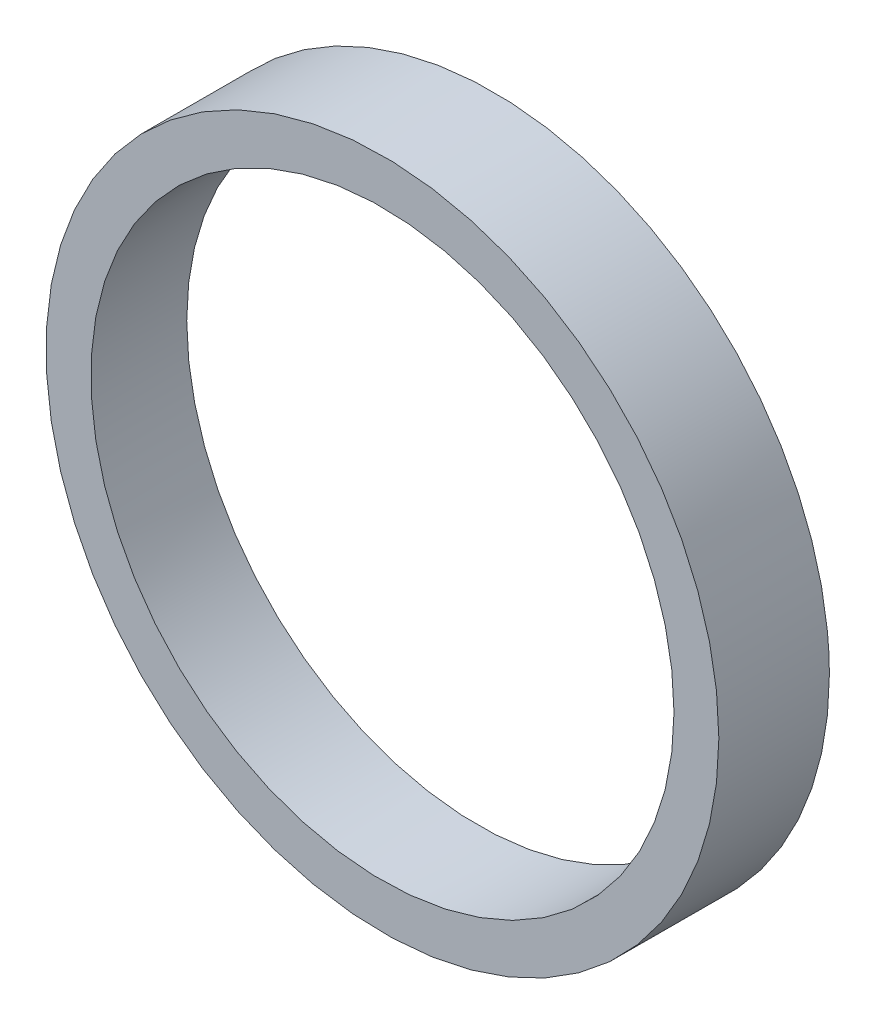
ISO-10303-21;
HEADER;
FILE_DESCRIPTION(('STEP AP214'),'2;1');
FILE_NAME('part.step','',(''),(''),'','','');
FILE_SCHEMA(('AUTOMOTIVE_DESIGN { 1 0 10303 214 1 1 1 1 }'));
ENDSEC;
DATA;
#1=APPLICATION_CONTEXT('core data for automotive mechanical design processes');
#2=APPLICATION_PROTOCOL_DEFINITION('international standard','automotive_design',2000,#1);
#3=PRODUCT_CONTEXT('',#1,'mechanical');
#4=PRODUCT('Part','Part','',(#3));
#5=PRODUCT_RELATED_PRODUCT_CATEGORY('part','',(#4));
#6=PRODUCT_DEFINITION_FORMATION('','',#4);
#7=PRODUCT_DEFINITION_CONTEXT('part definition',#1,'design');
#8=PRODUCT_DEFINITION('design','',#6,#7);
#9=PRODUCT_DEFINITION_SHAPE('','',#8);
#10=(LENGTH_UNIT() NAMED_UNIT(*) SI_UNIT(.MILLI.,.METRE.));
#11=(NAMED_UNIT(*) PLANE_ANGLE_UNIT() SI_UNIT($,.RADIAN.));
#12=(NAMED_UNIT(*) SI_UNIT($,.STERADIAN.) SOLID_ANGLE_UNIT());
#13=UNCERTAINTY_MEASURE_WITH_UNIT(LENGTH_MEASURE(1.E-05),#10,'distance_accuracy_value','');
#14=(GEOMETRIC_REPRESENTATION_CONTEXT(3) GLOBAL_UNCERTAINTY_ASSIGNED_CONTEXT((#13)) GLOBAL_UNIT_ASSIGNED_CONTEXT((#10,
#11,#12)) REPRESENTATION_CONTEXT('',''));
#15=CARTESIAN_POINT('',(0.,0.,0.));
#16=DIRECTION('',(0.,0.,1.));
#17=DIRECTION('',(1.,0.,0.));
#18=AXIS2_PLACEMENT_3D('',#15,#16,#17);
#19=CARTESIAN_POINT('',(0.,0.,10.6862696659689));
#20=DIRECTION('',(0.,0.,1.));
#21=DIRECTION('',(1.,0.,0.));
#22=AXIS2_PLACEMENT_3D('',#19,#20,#21);
#23=CYLINDRICAL_SURFACE('',#22,15.);
#24=CARTESIAN_POINT('',(0.,0.,18.35493));
#25=DIRECTION('',(0.,0.,1.));
#26=DIRECTION('',(1.,0.,0.));
#27=AXIS2_PLACEMENT_3D('',#24,#25,#26);
#28=CIRCLE('',#27,15.);
#29=CARTESIAN_POINT('',(15.,0.,18.35493));
#30=VERTEX_POINT('',#29);
#31=EDGE_CURVE('E11',#30,#30,#28,.T.);
#32=ORIENTED_EDGE('',*,*,#31,.F.);
#33=EDGE_LOOP('',(#32));
#34=FACE_BOUND('',#33,.T.);
#35=CARTESIAN_POINT('',(15.,0.,13.4264068711928));
#36=CARTESIAN_POINT('',(15.0000199770271,-0.245375497034634,13.4264016858656));
#37=CARTESIAN_POINT('',(14.9940151572913,-0.490753610266504,13.4263941756303));
#38=CARTESIAN_POINT('',(14.9699739919427,-0.980521236956322,13.4263883649765));
#39=CARTESIAN_POINT('',(14.9519571377994,-1.22491170772843,13.4263900496695));
#40=CARTESIAN_POINT('',(14.9038844137134,-1.71276826250471,13.4264163961721));
#41=CARTESIAN_POINT('',(14.8738157353264,-1.95623308396081,13.4264410824643));
#42=CARTESIAN_POINT('',(14.8017087579735,-2.4423077301061,13.426467444998));
#43=CARTESIAN_POINT('',(14.7596263284263,-2.68491100057215,13.4264690352615));
#44=CARTESIAN_POINT('',(14.6639170774719,-3.16649439026174,13.4264398724091));
#45=CARTESIAN_POINT('',(14.6103526551995,-3.40548690024482,13.4264092907541));
#46=CARTESIAN_POINT('',(14.4914827437983,-3.8804965677055,13.4263904351009));
#47=CARTESIAN_POINT('',(14.4261790768761,-4.11651418088109,13.426402154542));
#48=CARTESIAN_POINT('',(14.2838779248523,-4.58557269050521,13.426448777783));
#49=CARTESIAN_POINT('',(14.2068545800084,-4.81860573725198,13.4264837334434));
#50=CARTESIAN_POINT('',(14.0411387057669,-5.28168496325176,13.426536273815));
#51=CARTESIAN_POINT('',(13.9523944510197,-5.5117126229414,13.4265537784017));
#52=CARTESIAN_POINT('',(13.7643540661647,-5.96585696918062,13.4265383863849));
#53=CARTESIAN_POINT('',(13.6651219265721,-6.19000014637187,13.426505780671));
#54=CARTESIAN_POINT('',(13.4558068363664,-6.63300015490761,13.4264604982461));
#55=CARTESIAN_POINT('',(13.345730401943,-6.85186006363537,13.4264478096437));
#56=CARTESIAN_POINT('',(13.114772272728,-7.28420755137091,13.426444838234));
#57=CARTESIAN_POINT('',(12.9938752515186,-7.49768694320174,13.4264545877068));
#58=CARTESIAN_POINT('',(12.7412697147233,-7.91914660727904,13.4264979687867));
#59=CARTESIAN_POINT('',(12.6095254708261,-8.12710545907023,13.4265316823551));
#60=CARTESIAN_POINT('',(12.3364835944715,-8.53573934869997,13.4265545030027));
#61=CARTESIAN_POINT('',(12.1952161589136,-8.73643457086651,13.4265437451041));
#62=CARTESIAN_POINT('',(11.9032058467781,-9.13049680803047,13.4264987460191));
#63=CARTESIAN_POINT('',(11.7524727107051,-9.32387103836955,13.4264645286249));
#64=CARTESIAN_POINT('',(11.4415577716528,-9.70311212251682,13.4264132175773));
#65=CARTESIAN_POINT('',(11.2813689996461,-9.88897326465012,13.4263961367251));
#66=CARTESIAN_POINT('',(10.9515775846963,-10.2529943159107,13.4264012746602));
#67=CARTESIAN_POINT('',(10.7819523917999,-10.4311337938327,13.4264235918785));
#68=CARTESIAN_POINT('',(10.4350510958588,-10.7779876087998,13.4264604715956));
#69=CARTESIAN_POINT('',(10.2578183110673,-10.9467452886902,13.426475072972));
#70=CARTESIAN_POINT('',(9.89507441021608,-11.2756767533768,13.4264852388528));
#71=CARTESIAN_POINT('',(9.70955133281081,-11.4358373499339,13.4264807749104));
#72=CARTESIAN_POINT('',(9.33028223983738,-11.747350371589,13.4264776012048));
#73=CARTESIAN_POINT('',(9.13651239684372,-11.8986737869173,13.42647890942));
#74=CARTESIAN_POINT('',(8.74086600476507,-12.1923467797364,13.4264648868347));
#75=CARTESIAN_POINT('',(8.53895548377453,-12.3346505878111,13.4264494774024));
#76=CARTESIAN_POINT('',(8.13106307149784,-12.6073184890543,13.4264153564003));
#77=CARTESIAN_POINT('',(7.9251697883041,-12.737815117026,13.4263966909794));
#78=CARTESIAN_POINT('',(7.50642737861764,-12.9889975965783,13.4263988865024));
#79=CARTESIAN_POINT('',(7.29355499142698,-13.1096446796713,13.4264198964582));
#80=CARTESIAN_POINT('',(6.86099207296762,-13.3409611689156,13.4264778110716));
#81=CARTESIAN_POINT('',(6.64127114661918,-13.4515737140972,13.4265148002023));
#82=CARTESIAN_POINT('',(6.19515479601115,-13.6626606780385,13.4265609556781));
#83=CARTESIAN_POINT('',(5.9687237553191,-13.7630598027787,13.4265699281035));
#84=CARTESIAN_POINT('',(5.51402791410604,-13.9514827666865,13.4265417032825));
#85=CARTESIAN_POINT('',(5.28581988227721,-14.0396435745321,13.4265050722969));
#86=CARTESIAN_POINT('',(4.8251056691939,-14.2047131275852,13.4264589244707));
#87=CARTESIAN_POINT('',(4.59259535343477,-14.2816103402894,13.4264494352382));
#88=CARTESIAN_POINT('',(4.12343672544327,-14.4240588252737,13.4264547165827));
#89=CARTESIAN_POINT('',(3.88677890835644,-14.4895787915964,13.4264695529605));
#90=CARTESIAN_POINT('',(3.40947224609954,-14.6091271936941,13.4265211441416));
#91=CARTESIAN_POINT('',(3.16881041415688,-14.6631037480046,13.4265579951896));
#92=CARTESIAN_POINT('',(2.6858609794817,-14.7591213792078,13.4265827361134));
#93=CARTESIAN_POINT('',(2.44358031067962,-14.8011973619296,13.4265707708002));
#94=CARTESIAN_POINT('',(1.95782398199621,-14.8733704005704,13.4265238616404));
#95=CARTESIAN_POINT('',(1.71435249752584,-14.9034955217487,13.4264889721472));
#96=CARTESIAN_POINT('',(1.22634397069575,-14.9517116967635,13.4264361762349));
#97=CARTESIAN_POINT('',(0.981807528743092,-14.9698088220345,13.4264182612456));
#98=CARTESIAN_POINT('',(0.49180361339278,-14.9939606698047,13.4264013039084));
#99=CARTESIAN_POINT('',(0.246335321211981,-14.9999987555947,13.4264022876134));
#100=CARTESIAN_POINT('',(-0.244621729277353,-15.0000343232038,13.4263997423431));
#101=CARTESIAN_POINT('',(-0.490110487648506,-14.9940308393891,13.4263962130058));
#102=CARTESIAN_POINT('',(-0.980159229208044,-14.9699521874844,13.4264059106652));
#103=CARTESIAN_POINT('',(-1.22472002393864,-14.9518935631179,13.4264191147202));
#104=CARTESIAN_POINT('',(-1.71278043788775,-14.9037533574705,13.4264620267347));
#105=CARTESIAN_POINT('',(-1.95627945029845,-14.8736656308832,13.4264917431328));
#106=CARTESIAN_POINT('',(-2.44209670637423,-14.8015799674755,13.426522853894));
#107=CARTESIAN_POINT('',(-2.68441077687857,-14.7595539370425,13.4265241808812));
#108=CARTESIAN_POINT('',(-3.16690647874843,-14.6637010530643,13.4264908050466));
#109=CARTESIAN_POINT('',(-3.40708615952418,-14.6098643702528,13.4264560721238));
#110=CARTESIAN_POINT('',(-3.88372824943949,-14.49052661448,13.4264240816483));
#111=CARTESIAN_POINT('',(-4.12019997907399,-14.4250627873581,13.4264267064896));
#112=CARTESIAN_POINT('',(-4.58929106521987,-14.2826593263272,13.4264545463942));
#113=CARTESIAN_POINT('',(-4.82191545769364,-14.205736275734,13.4264797290726));
#114=CARTESIAN_POINT('',(-5.28317662143682,-14.0405671603567,13.4265311560645));
#115=CARTESIAN_POINT('',(-5.51181231171785,-13.9523180786074,13.4265574006595));
#116=CARTESIAN_POINT('',(-5.96657181411105,-13.7640134648401,13.426560800411));
#117=CARTESIAN_POINT('',(-6.1926547631023,-13.6638592295564,13.4265375136083));
#118=CARTESIAN_POINT('',(-6.63824920654205,-13.4531450815691,13.4264882588646));
#119=CARTESIAN_POINT('',(-6.85779215603014,-13.3426517071947,13.426462307976));
#120=CARTESIAN_POINT('',(-7.29018835274713,-13.1114839397205,13.4264301348457));
#121=CARTESIAN_POINT('',(-7.50306716185626,-12.9908573712782,13.4264238247474));
#122=CARTESIAN_POINT('',(-7.9220056877183,-12.7396112671199,13.426449501555));
#123=CARTESIAN_POINT('',(-8.12808332657684,-12.6090216050106,13.4264813778836));
#124=CARTESIAN_POINT('',(-8.53660118817628,-12.3360538225568,13.426518064495));
#125=CARTESIAN_POINT('',(-8.73894575274793,-12.1935325696605,13.4265224768191));
#126=CARTESIAN_POINT('',(-9.13515396813438,-11.8996438628237,13.4264999262729));
#127=CARTESIAN_POINT('',(-9.32906262045503,-11.7483370862344,13.4264731587986));
#128=CARTESIAN_POINT('',(-9.70830302597491,-11.437077316119,13.4264305602407));
#129=CARTESIAN_POINT('',(-9.8936705388231,-11.277167902863,13.4264146787714));
#130=CARTESIAN_POINT('',(-10.2557712706995,-10.9489336332832,13.4264014549327));
#131=CARTESIAN_POINT('',(-10.4325290337047,-10.7806358487504,13.4264040563296));
#132=CARTESIAN_POINT('',(-10.7792440747884,-10.4339904913696,13.4264115487304));
#133=CARTESIAN_POINT('',(-10.9491217135421,-10.2555632557264,13.4264164610482));
#134=CARTESIAN_POINT('',(-11.2793511914078,-9.89111438564408,13.4264348341146));
#135=CARTESIAN_POINT('',(-11.4397311036492,-9.70511818908261,13.4264482681378));
#136=CARTESIAN_POINT('',(-11.7509314571118,-9.3257257255248,13.4264842092147));
#137=CARTESIAN_POINT('',(-11.9017648276633,-9.13234006189703,13.4265067036793));
#138=CARTESIAN_POINT('',(-12.193897271746,-8.73838717457841,13.4265202077948));
#139=CARTESIAN_POINT('',(-12.3351927822006,-8.5378173094318,13.4265112057449));
#140=CARTESIAN_POINT('',(-12.6080578806949,-8.12969512567761,13.4264691529169));
#141=CARTESIAN_POINT('',(-12.7396113958987,-7.92213205544225,13.4264360633307));
#142=CARTESIAN_POINT('',(-12.991995442144,-7.50116988108807,13.426414019426));
#143=CARTESIAN_POINT('',(-13.1128476484261,-7.2877837748141,13.4264249737061));
#144=CARTESIAN_POINT('',(-13.3438816816623,-6.85533795553526,13.4264687947178));
#145=CARTESIAN_POINT('',(-13.4540644831779,-6.63627876304074,13.426501659446));
#146=CARTESIAN_POINT('',(-13.6637791449991,-6.19260902327883,13.4265607210396));
#147=CARTESIAN_POINT('',(-13.763290191957,-5.9679886430891,13.4265869050078));
#148=CARTESIAN_POINT('',(-13.9515868255456,-5.51354496669467,13.4265802625254));
#149=CARTESIAN_POINT('',(-14.0403410134536,-5.28370865871115,13.4265472675626));
#150=CARTESIAN_POINT('',(-14.2060795814694,-4.82088262211683,13.4264842612369));
#151=CARTESIAN_POINT('',(-14.2831103497671,-4.58790951480785,13.4264542382884));
#152=CARTESIAN_POINT('',(-14.4254553844375,-4.11885382994813,13.4264215275215));
#153=CARTESIAN_POINT('',(-14.4907898686473,-3.8827773902655,13.4264187920779));
#154=CARTESIAN_POINT('',(-14.6097403785441,-3.40753190100197,13.4264569976996));
#155=CARTESIAN_POINT('',(-14.6633488677856,-3.16836096651394,13.4264979667556));
#156=CARTESIAN_POINT('',(-14.7591852693014,-2.6862838514944,13.4265374597817));
#157=CARTESIAN_POINT('',(-14.8013441181098,-2.44336395460766,13.426535731714));
#158=CARTESIAN_POINT('',(-14.8735792518528,-1.95677450899431,13.426500192404));
#159=CARTESIAN_POINT('',(-14.9037055309679,-1.71311239179391,13.4264665159173));
#160=CARTESIAN_POINT('',(-14.9518651738117,-1.22497674477104,13.4264210619224));
#161=CARTESIAN_POINT('',(-14.969917219051,-0.980505059325288,13.4264092505338));
#162=CARTESIAN_POINT('',(-14.9940015167694,-0.490688788413429,13.4263995587927));
#163=CARTESIAN_POINT('',(-15.0000199446609,-0.245343522994723,13.4264016944509));
#164=CARTESIAN_POINT('',(-15.,0.,13.4264068711929));
#165=B_SPLINE_CURVE_WITH_KNOTS('',3,(#35,#36,#37,#38,#39,#40,#41,#42,#43,#44,#45,#46,#47,#48,
#49,#50,#51,#52,#53,#54,#55,#56,#57,#58,#59,#60,#61,#62,#63,#64,#65,#66,#67,#68,#69,#70,#71,#72,
#73,#74,#75,#76,#77,#78,#79,#80,#81,#82,#83,#84,#85,#86,#87,#88,#89,#90,#91,#92,#93,#94,#95,#96,
#97,#98,#99,#100,#101,#102,#103,#104,#105,#106,#107,#108,#109,#110,#111,#112,#113,#114,#115,
#116,#117,#118,#119,#120,#121,#122,#123,#124,#125,#126,#127,#128,#129,#130,#131,#132,#133,#134,
#135,#136,#137,#138,#139,#140,#141,#142,#143,#144,#145,#146,#147,#148,#149,#150,#151,#152,#153,
#154,#155,#156,#157,#158,#159,#160,#161,#162,#163,#164),.UNSPECIFIED.,.F.,.F.,(4,2,2,2,2,2,2,2,
2,2,2,2,2,2,2,2,2,2,2,2,2,2,2,2,2,2,2,2,2,2,2,2,2,2,2,2,2,2,2,2,2,2,2,2,2,2,2,2,2,2,2,2,2,2,2,2,
2,2,2,2,2,2,2,2,4),(0.,0.736056279968159,1.47092108702971,2.2065689738225,2.94495470426688,
3.67942503439743,4.41378145577007,5.14978240122567,5.88914726037371,6.62423629986398,
7.35888629764223,8.09459384802205,8.83282983049748,9.56882606260492,10.3040769628638,
11.0398766956797,11.777517333681,12.5114049183542,13.2463878995827,13.9836617199787,
14.7244184251793,15.4554219691106,16.1891764610102,16.9268583090293,17.6696348846108,
18.4032796535993,19.13767040915,19.8740509714397,20.6136746751525,21.3511059257315,
22.0867950020092,22.8221124380521,23.5584436227521,24.2948338574634,25.030215587958,
25.7659734838951,26.5034773402974,27.2415973192732,27.9773941378993,28.7121363038444,
29.4470745941197,30.1885980931061,30.9256406036805,31.6593814246024,32.3910026648616,
33.133201015808,33.870773105521,34.6049078759426,35.3368100145011,36.0755990050978,
36.8120824250019,37.5475460490584,38.283282918311,39.0202077815576,39.7556041434662,
40.4909332695395,41.2276713962637,41.9665107194644,42.702345957594,43.4368967067293,
44.1719181827094,44.9112794639,45.6475359891214,46.3826507111206,47.1186094712608),.UNSPECIFIED.);
#166=CARTESIAN_POINT('',(15.,0.,13.4264068711929));
#167=VERTEX_POINT('',#166);
#168=CARTESIAN_POINT('',(-15.,0.,13.4264068711928));
#169=VERTEX_POINT('',#168);
#170=EDGE_CURVE('E58',#167,#169,#165,.T.);
#171=ORIENTED_EDGE('',*,*,#170,.F.);
#172=CARTESIAN_POINT('',(-15.,0.,13.4264068711929));
#173=CARTESIAN_POINT('',(-15.0000199770271,0.245375497062535,13.4264016858656));
#174=CARTESIAN_POINT('',(-14.9940151572917,0.490753610322417,13.4263941756297));
#175=CARTESIAN_POINT('',(-14.9699739919431,0.980521237049807,13.4263883649743));
#176=CARTESIAN_POINT('',(-14.9519571378001,1.22491170783152,13.4263900496664));
#177=CARTESIAN_POINT('',(-14.9038844137143,1.71276826260827,13.4264163961675));
#178=CARTESIAN_POINT('',(-14.8738157353281,1.95623308405532,13.4264410824593));
#179=CARTESIAN_POINT('',(-14.8017087579744,2.44230773016304,13.4264674449942));
#180=CARTESIAN_POINT('',(-14.7596263284265,2.68491100060069,13.4264690352595));
#181=CARTESIAN_POINT('',(-14.663917077467,3.16649439025618,13.4264398724112));
#182=CARTESIAN_POINT('',(-14.6103526551889,3.40548690023333,13.4264092907586));
#183=CARTESIAN_POINT('',(-14.491482743781,3.88049656768624,13.4263904351085));
#184=CARTESIAN_POINT('',(-14.4261790768576,4.11651418085996,13.4264021545503));
#185=CARTESIAN_POINT('',(-14.2838779248338,4.58557269048387,13.4264487777916));
#186=CARTESIAN_POINT('',(-14.206854579991,4.81860573723226,13.4264837334515));
#187=CARTESIAN_POINT('',(-14.0411387057565,5.28168496323982,13.42653627382));
#188=CARTESIAN_POINT('',(-13.9523944510153,5.51171262293561,13.4265537784039));
#189=CARTESIAN_POINT('',(-13.7643540661856,5.96585696914679,13.4265383863826));
#190=CARTESIAN_POINT('',(-13.6651219266145,6.19000014630466,13.426505780667));
#191=CARTESIAN_POINT('',(-13.4558068364373,6.63300015479564,13.426460498241));
#192=CARTESIAN_POINT('',(-13.3457304020199,6.85186006351149,13.4264478096394));
#193=CARTESIAN_POINT('',(-13.1147722728043,7.2842075512463,13.4264448382319));
#194=CARTESIAN_POINT('',(-12.9938752515871,7.49768694308771,13.426454587706));
#195=CARTESIAN_POINT('',(-12.7412697147653,7.91914660721097,13.426497968787));
#196=CARTESIAN_POINT('',(-12.6095254708481,8.12710545903687,13.4265316823551));
#197=CARTESIAN_POINT('',(-12.3364835945026,8.53573934865403,13.4265545030025));
#198=CARTESIAN_POINT('',(-12.1952161589774,8.73643457077585,13.4265437451041));
#199=CARTESIAN_POINT('',(-11.9032058468859,9.13049680788018,13.4264987460211));
#200=CARTESIAN_POINT('',(-11.7524727108227,9.32387103820328,13.4264645286287));
#201=CARTESIAN_POINT('',(-11.4415577717697,9.70311212234943,13.4264132175841));
#202=CARTESIAN_POINT('',(-11.281368999751,9.88897326449644,13.4263961367331));
#203=CARTESIAN_POINT('',(-10.95157758476,10.2529943158189,13.4264012746662));
#204=CARTESIAN_POINT('',(-10.7819523918331,10.4311337937879,13.4264235918814));
#205=CARTESIAN_POINT('',(-10.4350510959183,10.7779876087519,13.4264604715927));
#206=CARTESIAN_POINT('',(-10.2578183111882,10.9467452885967,13.4264750729664));
#207=CARTESIAN_POINT('',(-9.89507441041854,11.2756767532225,13.4264852388465));
#208=CARTESIAN_POINT('',(-9.70955133303179,11.4358373497624,13.4264807749059));
#209=CARTESIAN_POINT('',(-9.33028224005767,11.7473503714168,13.4264776012042));
#210=CARTESIAN_POINT('',(-9.13651239704321,11.8986737867598,13.4264789094213));
#211=CARTESIAN_POINT('',(-8.74086600488493,12.1923467796421,13.4264648868376));
#212=CARTESIAN_POINT('',(-8.5389554838341,12.3346505877632,13.4264494774048));
#213=CARTESIAN_POINT('',(-8.13106307143165,12.6073184891066,13.4264153563979));
#214=CARTESIAN_POINT('',(-7.92516978817219,12.7378151171316,13.4263966909728));
#215=CARTESIAN_POINT('',(-7.50642737839679,12.9889975967526,13.4263988864883));
#216=CARTESIAN_POINT('',(-7.29355499118434,13.1096446798633,13.4264198964407));
#217=CARTESIAN_POINT('',(-6.86099207272537,13.3409611691084,13.42647781105));
#218=CARTESIAN_POINT('',(-6.64127114640037,13.4515737142754,13.4265148001799));
#219=CARTESIAN_POINT('',(-6.19515479587927,13.6626606781445,13.4265609556627));
#220=CARTESIAN_POINT('',(-5.96872375525181,13.7630598028294,13.426569928096));
#221=CARTESIAN_POINT('',(-5.51402791399101,13.9514827667115,13.4265417032899));
#222=CARTESIAN_POINT('',(-5.28581988204614,14.0396435745777,13.4265050723113));
#223=CARTESIAN_POINT('',(-4.82510566880906,14.2047131276581,13.4264589244902));
#224=CARTESIAN_POINT('',(-4.5925953530135,14.2816103403727,13.426449435256));
#225=CARTESIAN_POINT('',(-4.12343672502355,14.4240588253569,13.426454716595));
#226=CARTESIAN_POINT('',(-3.88677890797584,14.4895787916729,13.426469552969));
#227=CARTESIAN_POINT('',(-3.40947224587113,14.6091271937375,13.4265211441444));
#228=CARTESIAN_POINT('',(-3.16881041404248,14.6631037480252,13.4265579951903));
#229=CARTESIAN_POINT('',(-2.6858609794821,14.7591213792097,13.4265827361127));
#230=CARTESIAN_POINT('',(-2.44358031067972,14.80119736193,13.4265707708));
#231=CARTESIAN_POINT('',(-1.95782398199609,14.8733704005699,13.4265238616406));
#232=CARTESIAN_POINT('',(-1.71435249752581,14.9034955217485,13.4264889721472));
#233=CARTESIAN_POINT('',(-1.22634397069577,14.9517116967637,13.4264361762348));
#234=CARTESIAN_POINT('',(-0.981807528743095,14.9698088220346,13.4264182612456));
#235=CARTESIAN_POINT('',(-0.491803613392765,14.9939606698047,13.4264013039084));
#236=CARTESIAN_POINT('',(-0.24633532121197,14.9999987555946,13.4264022876134));
#237=CARTESIAN_POINT('',(0.244621729284041,15.000034323204,13.426399742343));
#238=CARTESIAN_POINT('',(0.490110487661875,14.9940308393892,13.4263962130057));
#239=CARTESIAN_POINT('',(0.980159229230358,14.9699521874843,13.4264059106647));
#240=CARTESIAN_POINT('',(1.22472002396323,14.9518935631178,13.4264191147196));
#241=CARTESIAN_POINT('',(1.71278043791246,14.9037533574705,13.4264620267337));
#242=CARTESIAN_POINT('',(1.95627945032104,14.8736656308835,13.4264917431316));
#243=CARTESIAN_POINT('',(2.44209670638774,14.8015799674752,13.4265228538933));
#244=CARTESIAN_POINT('',(2.68441077688517,14.7595539370414,13.4265241808812));
#245=CARTESIAN_POINT('',(3.16690647880108,14.6637010530536,13.4264908050467));
#246=CARTESIAN_POINT('',(3.40708615962924,14.6098643702302,13.4264560721235));
#247=CARTESIAN_POINT('',(3.88372824961449,14.4905266144403,13.4264240816459));
#248=CARTESIAN_POINT('',(4.12019997926697,14.4250627873149,13.4264267064856));
#249=CARTESIAN_POINT('',(4.58929106541362,14.2826593262843,13.4264545463876));
#250=CARTESIAN_POINT('',(4.82191545787072,14.2057362756964,13.426479729065));
#251=CARTESIAN_POINT('',(5.28317662154284,14.0405671603326,13.4265311560589));
#252=CARTESIAN_POINT('',(5.51181231177008,13.9523180785931,13.4265574006571));
#253=CARTESIAN_POINT('',(5.96657181422172,13.7640134647868,13.4265608004135));
#254=CARTESIAN_POINT('',(6.19265476332192,13.6638592294465,13.4265375136124));
#255=CARTESIAN_POINT('',(6.63824920690691,13.4531450813825,13.4264882588669));
#256=CARTESIAN_POINT('',(6.85779215643299,13.3426517069916,13.426462307975));
#257=CARTESIAN_POINT('',(7.29018835315131,13.1114839395182,13.4264301348385));
#258=CARTESIAN_POINT('',(7.5030671622257,12.9908573710967,13.4264238247374));
#259=CARTESIAN_POINT('',(7.92200568793938,12.7396112670091,13.4264495015463));
#260=CARTESIAN_POINT('',(8.12808332668639,12.6090216049533,13.426481377879));
#261=CARTESIAN_POINT('',(8.53660118823101,12.336053822504,13.4265180644997));
#262=CARTESIAN_POINT('',(8.73894575285397,12.1935325695509,13.4265224768292));
#263=CARTESIAN_POINT('',(9.13515396830962,11.8996438626396,13.426499926287));
#264=CARTESIAN_POINT('',(9.32906262064954,11.7483370860345,13.4264731588114));
#265=CARTESIAN_POINT('',(9.70830302617011,11.4370773159203,13.4264305602495));
#266=CARTESIAN_POINT('',(9.89367053900125,11.2771679026831,13.4264146787776));
#267=CARTESIAN_POINT('',(10.2557712708056,10.9489336331746,13.4264014549347));
#268=CARTESIAN_POINT('',(10.4325290337575,10.7806358486959,13.42640405633));
#269=CARTESIAN_POINT('',(10.7792440747828,10.4339904913772,13.4264115487299));
#270=CARTESIAN_POINT('',(10.9491217135291,10.2555632557397,13.4264164610483));
#271=CARTESIAN_POINT('',(11.2793511913856,9.89111438566553,13.4264348341155));
#272=CARTESIAN_POINT('',(11.4397311036249,9.70511818910634,13.4264482681389));
#273=CARTESIAN_POINT('',(11.7509314570875,9.32572572554853,13.4264842092162));
#274=CARTESIAN_POINT('',(11.9017648276408,9.13234006191829,13.4265067036811));
#275=CARTESIAN_POINT('',(12.1938972717326,8.73838717459128,13.426520207796));
#276=CARTESIAN_POINT('',(12.3351927821943,8.53781730943857,13.4265112057454));
#277=CARTESIAN_POINT('',(12.6080578806806,8.12969512570143,13.4264691529164));
#278=CARTESIAN_POINT('',(12.7396113958708,7.92213205549024,13.42643606333));
#279=CARTESIAN_POINT('',(12.9919954420981,7.50116988116816,13.4264140194258));
#280=CARTESIAN_POINT('',(13.112847648375,7.28778377490167,13.4264249737067));
#281=CARTESIAN_POINT('',(13.3438816816109,6.85533795562237,13.42646879472));
#282=CARTESIAN_POINT('',(13.4540644831306,6.6362787631195,13.4265016594488));
#283=CARTESIAN_POINT('',(13.6637791449708,6.19260902332607,13.426560721042));
#284=CARTESIAN_POINT('',(13.7632901919429,5.9679886431128,13.4265869050092));
#285=CARTESIAN_POINT('',(13.9515868255526,5.51354496668815,13.426580262524));
#286=CARTESIAN_POINT('',(14.0403410134685,5.28370865869832,13.4265472675593));
#287=CARTESIAN_POINT('',(14.206079581494,4.82088262209535,13.4264842612311));
#288=CARTESIAN_POINT('',(14.2831103497939,4.58790951478414,13.4264542382819));
#289=CARTESIAN_POINT('',(14.4254553844644,4.11885382992445,13.4264215275146));
#290=CARTESIAN_POINT('',(14.4907898686725,3.88277739024416,13.4264187920712));
#291=CARTESIAN_POINT('',(14.6097403785592,3.40753190098913,13.4264569976954));
#292=CARTESIAN_POINT('',(14.6633488677926,3.16836096650731,13.4264979667536));
#293=CARTESIAN_POINT('',(14.7591852693013,2.68628385146587,13.4265374597837));
#294=CARTESIAN_POINT('',(14.8013441181089,2.44336395455068,13.4265357317177));
#295=CARTESIAN_POINT('',(14.873579251851,1.95677450889968,13.4265001924091));
#296=CARTESIAN_POINT('',(14.9037055309669,1.71311239169023,13.4264665159219));
#297=CARTESIAN_POINT('',(14.951865173811,1.22497674466784,13.4264210619256));
#298=CARTESIAN_POINT('',(14.9699172190507,0.980505059231708,13.426409250536));
#299=CARTESIAN_POINT('',(14.9940015167689,0.490688788357464,13.4263995587933));
#300=CARTESIAN_POINT('',(15.0000199446608,0.245343522966799,13.426401694451));
#301=CARTESIAN_POINT('',(15.,0.,13.4264068711928));
#302=B_SPLINE_CURVE_WITH_KNOTS('',3,(#172,#173,#174,#175,#176,#177,#178,#179,#180,#181,#182,
#183,#184,#185,#186,#187,#188,#189,#190,#191,#192,#193,#194,#195,#196,#197,#198,#199,#200,#201,
#202,#203,#204,#205,#206,#207,#208,#209,#210,#211,#212,#213,#214,#215,#216,#217,#218,#219,#220,
#221,#222,#223,#224,#225,#226,#227,#228,#229,#230,#231,#232,#233,#234,#235,#236,#237,#238,#239,
#240,#241,#242,#243,#244,#245,#246,#247,#248,#249,#250,#251,#252,#253,#254,#255,#256,#257,#258,
#259,#260,#261,#262,#263,#264,#265,#266,#267,#268,#269,#270,#271,#272,#273,#274,#275,#276,#277,
#278,#279,#280,#281,#282,#283,#284,#285,#286,#287,#288,#289,#290,#291,#292,#293,#294,#295,#296,
#297,#298,#299,#300,#301),.UNSPECIFIED.,.F.,.F.,(4,2,2,2,2,2,2,2,2,2,2,2,2,2,2,2,2,2,2,2,2,2,2,
2,2,2,2,2,2,2,2,2,2,2,2,2,2,2,2,2,2,2,2,2,2,2,2,2,2,2,2,2,2,2,2,2,2,2,2,2,2,2,2,2,4),(0.,
0.736056280052021,1.47092108714221,2.20656897390764,2.94495470426823,3.67942503438527,
4.41378145575365,5.14978240121315,5.8891472603721,6.62423629974465,7.3588862974826,
8.09459384790161,8.83282983049697,9.56882606243816,10.304076962641,11.0398766955119,
11.7775173336786,12.5114049181241,13.2463878992764,13.9836617197488,14.7244184251779,
15.4554219693612,16.1891764613437,16.9268583092794,17.6696348846161,18.4032796539521,
19.1376704096171,19.8740509717883,20.6136746751525,21.3511059257316,22.0867950020093,
22.8221124380522,23.5584436227522,24.2948338574835,25.0302155879849,25.7659734839155,
26.5034773402977,27.2415973194347,27.9773941381157,28.7121363040078,29.447074594122,
30.1885980934761,30.9256406041748,31.6593814249748,32.3910026648653,33.133201016036,
33.8707731058245,34.6049078761702,35.336810014501,36.0755990050699,36.8120824249648,
37.5475460490305,38.2832829183104,39.0202077814739,39.7556041433552,40.4909332694565,
41.2276713962626,41.9665107194894,42.7023459576273,43.4368967067541,44.1719181827107,
44.9112794639851,45.647535989234,46.3826507112045,47.1186094712607),.UNSPECIFIED.);
#303=EDGE_CURVE('E51',#169,#167,#302,.T.);
#304=ORIENTED_EDGE('',*,*,#303,.F.);
#305=EDGE_LOOP('',(#171,#304));
#306=FACE_BOUND('',#305,.T.);
#307=ADVANCED_FACE('F38',(#34,#306),#23,.T.);
#308=CARTESIAN_POINT('',(45.,0.,-29.));
#309=CARTESIAN_POINT('',(45.,45.,-29.));
#310=CARTESIAN_POINT('',(0.,45.,-29.));
#311=CARTESIAN_POINT('',(-45.,45.,-29.));
#312=CARTESIAN_POINT('',(-45.,0.,-29.));
#313=CARTESIAN_POINT('',(45.,0.,-29.));
#314=CARTESIAN_POINT('',(45.,45.,16.));
#315=CARTESIAN_POINT('',(0.,45.,16.));
#316=CARTESIAN_POINT('',(-45.,45.,16.));
#317=CARTESIAN_POINT('',(-45.,0.,-29.));
#318=CARTESIAN_POINT('',(45.,0.,-29.));
#319=CARTESIAN_POINT('',(45.,0.,16.));
#320=CARTESIAN_POINT('',(0.,0.,16.));
#321=CARTESIAN_POINT('',(-45.,0.,16.));
#322=CARTESIAN_POINT('',(-45.,0.,-29.));
#323=CARTESIAN_POINT('',(45.,0.,-29.));
#324=CARTESIAN_POINT('',(45.,-45.,16.));
#325=CARTESIAN_POINT('',(0.,-45.,16.));
#326=CARTESIAN_POINT('',(-45.,-45.,16.));
#327=CARTESIAN_POINT('',(-45.,0.,-29.));
#328=CARTESIAN_POINT('',(45.,0.,-29.));
#329=CARTESIAN_POINT('',(45.,-45.,-29.));
#330=CARTESIAN_POINT('',(0.,-45.,-29.));
#331=CARTESIAN_POINT('',(-45.,-45.,-29.));
#332=CARTESIAN_POINT('',(-45.,0.,-29.));
#333=(BOUNDED_SURFACE() B_SPLINE_SURFACE(2,2,((#308,#309,#310,#311,#312),(#313,#314,#315,#316,
#317),(#318,#319,#320,#321,#322),(#323,#324,#325,#326,#327),(#328,#329,#330,#331,#332)),
.UNSPECIFIED.,.F.,.F.,.F.) B_SPLINE_SURFACE_WITH_KNOTS((3,2,3),(3,2,3),(0.,0.5,1.),(0.,0.5,1.),
.UNSPECIFIED.) GEOMETRIC_REPRESENTATION_ITEM() RATIONAL_B_SPLINE_SURFACE(((1.,0.707106781186548,
1.,0.707106781186548,1.),(0.707106781186548,0.5,0.707106781186548,0.5,0.707106781186548),(1.,
0.707106781186548,1.,0.707106781186548,1.),(0.707106781186548,0.5,0.707106781186548,0.5,
0.707106781186548),(1.,0.707106781186548,1.,0.707106781186548,1.))) REPRESENTATION_ITEM('') SURFACE());
#334=CARTESIAN_POINT('',(13.,0.,14.081318457076));
#335=CARTESIAN_POINT('',(13.0000026206347,-0.36523931782071,14.081318457087));
#336=CARTESIAN_POINT('',(12.9846013920702,-0.7304356291069,14.0813184571154));
#337=CARTESIAN_POINT('',(12.9231039910268,-1.45835439615203,14.0813184571011));
#338=CARTESIAN_POINT('',(12.8769997434288,-1.82107617573009,14.0813184570584));
#339=CARTESIAN_POINT('',(12.7543465103285,-2.54173133793915,14.0813184570937));
#340=CARTESIAN_POINT('',(12.6777648026472,-2.89965914518093,14.0813184571717));
#341=CARTESIAN_POINT('',(12.4947034681866,-3.60778591059158,14.0813184571746));
#342=CARTESIAN_POINT('',(12.3882239494821,-3.95798489669367,14.0813184570994));
#343=CARTESIAN_POINT('',(12.14618327392,-4.64799338739137,14.0813184570526));
#344=CARTESIAN_POINT('',(12.0106362224617,-4.98780784016206,14.0813184570809));
#345=CARTESIAN_POINT('',(11.7113915896659,-5.6548138519146,14.0813184570941));
#346=CARTESIAN_POINT('',(11.5476935638249,-5.98200521147809,14.0813184570789));
#347=CARTESIAN_POINT('',(11.1933577853844,-6.62135083130635,14.0813184570731));
#348=CARTESIAN_POINT('',(11.0027269094357,-6.93350890276171,14.0813184570824));
#349=CARTESIAN_POINT('',(10.5958497218712,-7.54065730816614,14.0813184570838));
#350=CARTESIAN_POINT('',(10.379603510472,-7.83564770927473,14.0813184570759));
#351=CARTESIAN_POINT('',(9.92300776309089,-8.40639574209261,14.0813184570762));
#352=CARTESIAN_POINT('',(9.68265566792243,-8.68215132646903,14.0813184570845));
#353=CARTESIAN_POINT('',(9.17957575962517,-9.2124351614506,14.0813184570845));
#354=CARTESIAN_POINT('',(8.91684792382094,-9.46696339054357,14.0813184570761));
#355=CARTESIAN_POINT('',(8.3708738640295,-9.95299220636969,14.0813184570759));
#356=CARTESIAN_POINT('',(8.08762684182144,-10.1844918964329,14.081318457084));
#357=CARTESIAN_POINT('',(7.5026373034994,-10.6228064356217,14.0813184570841));
#358=CARTESIAN_POINT('',(7.20089479100652,-10.8296212895801,14.081318457076));
#359=CARTESIAN_POINT('',(6.58106527343348,-11.2170922247337,14.0813184570761));
#360=CARTESIAN_POINT('',(6.26297857195565,-11.3977487915957,14.0813184570842));
#361=CARTESIAN_POINT('',(5.61271692698066,-11.731623366259,14.0813184570842));
#362=CARTESIAN_POINT('',(5.28054198322382,-11.8848413735545,14.081318457076));
#363=CARTESIAN_POINT('',(4.60446611512995,-12.1627492520255,14.081318457076));
#364=CARTESIAN_POINT('',(4.26056521451635,-12.2874391809137,14.0813184570841));
#365=CARTESIAN_POINT('',(3.56348172007341,-12.5074048308025,14.0813184570841));
#366=CARTESIAN_POINT('',(3.21029912625476,-12.602680551837,14.081318457076));
#367=CARTESIAN_POINT('',(2.49716247488075,-12.763140587475,14.081318457076));
#368=CARTESIAN_POINT('',(2.13720840438994,-12.8283248445892,14.0813184570841));
#369=CARTESIAN_POINT('',(1.41308851806422,-12.9281382620257,14.0813184570841));
#370=CARTESIAN_POINT('',(1.0489227022305,-12.9627674223568,14.081318457076));
#371=CARTESIAN_POINT('',(0.31896898974315,-13.0012244186339,14.081318457076));
#372=CARTESIAN_POINT('',(-0.0468189039824762,-13.0050523101565,14.0813184570841));
#373=CARTESIAN_POINT('',(-0.777416897171047,-12.9818797008389,14.0813184570841));
#374=CARTESIAN_POINT('',(-1.14222699663518,-12.9548792000359,14.081318457076));
#375=CARTESIAN_POINT('',(-1.86827596087431,-12.870241747267,14.081318457076));
#376=CARTESIAN_POINT('',(-2.22951482431449,-12.8126047838505,14.0813184570841));
#377=CARTESIAN_POINT('',(-2.94585298921746,-12.667104162577,14.0813184570841));
#378=CARTESIAN_POINT('',(-3.30095229067213,-12.57924050468,14.081318457076));
#379=CARTESIAN_POINT('',(-4.0024871616024,-12.3739110431097,14.081318457076));
#380=CARTESIAN_POINT('',(-4.34892272192373,-12.2564452081597,14.0813184570841));
#381=CARTESIAN_POINT('',(-5.03066676950366,-11.992746550996,14.0813184570841));
#382=CARTESIAN_POINT('',(-5.36597525675655,-11.8465137287676,14.081318457076));
#383=CARTESIAN_POINT('',(-6.02308120596354,-11.526320778176,14.081318457076));
#384=CARTESIAN_POINT('',(-6.34487867232074,-11.352360658849,14.0813184570841));
#385=CARTESIAN_POINT('',(-6.97267490742048,-10.9779498327389,14.0813184570841));
#386=CARTESIAN_POINT('',(-7.27867367617457,-10.7774991259753,14.081318457076));
#387=CARTESIAN_POINT('',(-7.87269692705095,-10.3515322963052,14.081318457076));
#388=CARTESIAN_POINT('',(-8.16072141645392,-10.1260161835519,14.0813184570841));
#389=CARTESIAN_POINT('',(-8.71674856290724,-9.65152175967457,14.0813184570841));
#390=CARTESIAN_POINT('',(-8.98475121995992,-9.40254344855324,14.081318457076));
#391=CARTESIAN_POINT('',(-9.4988293994696,-8.88289467813791,14.081318457076));
#392=CARTESIAN_POINT('',(-9.74490491891778,-8.61222421586734,14.0813184570841));
#393=CARTESIAN_POINT('',(-10.2133793326635,-8.05111547739586,14.0813184570841));
#394=CARTESIAN_POINT('',(-10.4357782269552,-7.76067720119001,14.081318457076));
#395=CARTESIAN_POINT('',(-10.8553182951064,-7.16209763756753,14.081318457076));
#396=CARTESIAN_POINT('',(-11.052459465663,-6.85395634783583,14.0813184570841));
#397=CARTESIAN_POINT('',(-11.4200824964803,-6.22216149194017,14.0813184570841));
#398=CARTESIAN_POINT('',(-11.59056435674,-5.89850792577566,14.081318457076));
#399=CARTESIAN_POINT('',(-11.9036567362061,-5.23798951443267,14.081318457076));
#400=CARTESIAN_POINT('',(-12.0462672566072,-4.90112466982057,14.0813184570841));
#401=CARTESIAN_POINT('',(-12.3026030900536,-4.21657859588739,14.0813184570841));
#402=CARTESIAN_POINT('',(-12.416328403101,-3.86889736656717,14.081318457076));
#403=CARTESIAN_POINT('',(-12.6140852985168,-3.16519034442004,14.081318457076));
#404=CARTESIAN_POINT('',(-12.6981168822237,-2.8091645519693,14.0813184570841));
#405=CARTESIAN_POINT('',(-12.835888911913,-2.09129951840157,14.0813184570841));
#406=CARTESIAN_POINT('',(-12.8896293578961,-1.72946027728473,14.081318457076));
#407=CARTESIAN_POINT('',(-12.9664370497835,-1.00254080647464,14.081318457076));
#408=CARTESIAN_POINT('',(-12.9895042956876,-0.637460576781382,14.0813184570841));
#409=CARTESIAN_POINT('',(-13.0048015931282,0.0933453696058344,14.0813184570841));
#410=CARTESIAN_POINT('',(-12.9970316446638,0.459071086299813,14.081318457076));
#411=CARTESIAN_POINT('',(-12.9507097919933,1.18856793253621,14.081318457076));
#412=CARTESIAN_POINT('',(-12.9121578863996,1.55233906199051,14.0813184570841));
#413=CARTESIAN_POINT('',(-12.8045461986985,2.2753405222353,14.0813184570841));
#414=CARTESIAN_POINT('',(-12.7354864165889,2.63457085302544,14.081318457076));
#415=CARTESIAN_POINT('',(-12.5673499459435,3.3459368186449,14.081318457076));
#416=CARTESIAN_POINT('',(-12.468273256121,3.69807245317007,14.0813184570841));
#417=CARTESIAN_POINT('',(-12.2408073470745,4.39274553667417,14.0813184570841));
#418=CARTESIAN_POINT('',(-12.1124181278514,4.73528298565345,14.081318457076));
#419=CARTESIAN_POINT('',(-11.8272399492247,5.40832441766634,14.081318457076));
#420=CARTESIAN_POINT('',(-11.6704509935349,5.73882840227361,14.0813184570841));
#421=CARTESIAN_POINT('',(-11.3295880061625,6.38545326768096,14.0813184570841));
#422=CARTESIAN_POINT('',(-11.1455139744868,6.70157414848464,14.081318457076));
#423=CARTESIAN_POINT('',(-10.7513895180958,7.31718533431274,14.081318457076));
#424=CARTESIAN_POINT('',(-10.5413390969451,7.61667564161917,14.0813184570841));
#425=CARTESIAN_POINT('',(-10.0967551737142,8.19689653152951,14.0813184570841));
#426=CARTESIAN_POINT('',(-9.86222167163126,8.47762711413124,14.081318457076));
#427=CARTESIAN_POINT('',(-9.37033887879736,9.01833283878638,14.081318457076));
#428=CARTESIAN_POINT('',(-9.11298957880456,9.27830797243245,14.0813184570841));
#429=CARTESIAN_POINT('',(-8.5773048713073,9.77565440467804,14.0813184570841));
#430=CARTESIAN_POINT('',(-8.2989694637875,10.013025703261,14.081318457076));
#431=CARTESIAN_POINT('',(-7.72329124625841,10.4634769702748,14.081318457076));
#432=CARTESIAN_POINT('',(-7.42594843005479,10.6765569307891,14.0813184570841));
#433=CARTESIAN_POINT('',(-6.81436940823406,11.076910559809,14.0813184570841));
#434=CARTESIAN_POINT('',(-6.50013320262562,11.2641842283278,14.081318457076));
#435=CARTESIAN_POINT('',(-5.85700177556496,11.6115936848007,14.081318457076));
#436=CARTESIAN_POINT('',(-5.52810656960142,11.7717295014278,14.0813184570841));
#437=CARTESIAN_POINT('',(-4.85799507844361,12.0637250265747,14.0813184570841));
#438=CARTESIAN_POINT('',(-4.51677879326566,12.1955847351319,14.081318457076));
#439=CARTESIAN_POINT('',(-3.82445111365683,12.430090557941,14.081318457076));
#440=CARTESIAN_POINT('',(-3.47333972292438,12.5327366831117,14.0813184570841));
#441=CARTESIAN_POINT('',(-2.76371789692777,12.7080856538614,14.0813184570841));
#442=CARTESIAN_POINT('',(-2.40520746165462,12.7807884994041,14.081318457076));
#443=CARTESIAN_POINT('',(-1.68333568477794,12.8957341417122,14.081318457076));
#444=CARTESIAN_POINT('',(-1.31997433442276,12.9379768835163,14.0813184570841));
#445=CARTESIAN_POINT('',(-0.590984647796229,12.9917017833757,14.0813184570841));
#446=CARTESIAN_POINT('',(-0.225356311524236,13.0031839414222,14.081318457076));
#447=CARTESIAN_POINT('',(0.505567244941304,12.9953060499753,14.081318457076));
#448=CARTESIAN_POINT('',(0.870862465769925,12.9759460594051,14.0813184570841));
#449=CARTESIAN_POINT('',(1.59852346679291,12.9065216188527,14.0813184570841));
#450=CARTESIAN_POINT('',(1.9608892469839,12.856457168835,14.081318457076));
#451=CARTESIAN_POINT('',(2.68011589659972,12.725979604413,14.081318457076));
#452=CARTESIAN_POINT('',(3.03697675488643,12.6455664286124,14.0813184570842));
#453=CARTESIAN_POINT('',(3.74265572964055,12.4549631150994,14.0813184570842));
#454=CARTESIAN_POINT('',(4.09147384625621,12.3447729779358,14.0813184570761));
#455=CARTESIAN_POINT('',(4.77859383825356,12.0953968101868,14.081318457076));
#456=CARTESIAN_POINT('',(5.11689551823692,11.9562102412091,14.0813184570841));
#457=CARTESIAN_POINT('',(5.78057071124931,11.6498319890591,14.081318457084));
#458=CARTESIAN_POINT('',(6.10594422174721,11.4826403004039,14.0813184570759));
#459=CARTESIAN_POINT('',(6.74143732146468,11.1214475485525,14.0813184570761));
#460=CARTESIAN_POINT('',(7.051557503883,10.9274475290463,14.0813184570845));
#461=CARTESIAN_POINT('',(7.65435253542749,10.514012540541,14.0813184570845));
#462=CARTESIAN_POINT('',(7.94702740223252,10.2945775973179,14.0813184570762));
#463=CARTESIAN_POINT('',(8.51282138619762,9.83185720528738,14.0813184570759));
#464=CARTESIAN_POINT('',(8.78594257815822,9.58857429344863,14.0813184570838));
#465=CARTESIAN_POINT('',(9.3107232377096,9.07986662562127,14.0813184570824));
#466=CARTESIAN_POINT('',(9.56238262133245,8.81444178301184,14.0813184570731));
#467=CARTESIAN_POINT('',(10.0425110219919,8.26326723320305,14.0813184570789));
#468=CARTESIAN_POINT('',(10.2709741107327,7.97751236181811,14.0813184570941));
#469=CARTESIAN_POINT('',(10.7030086671508,7.38777469807963,14.0813184570809));
#470=CARTESIAN_POINT('',(10.9065805278393,7.08379219363782,14.0813184570526));
#471=CARTESIAN_POINT('',(11.2874816245109,6.45960491371625,14.0813184570994));
#472=CARTESIAN_POINT('',(11.4647981006966,6.1393923514337,14.0813184571746));
#473=CARTESIAN_POINT('',(11.7918088059142,5.48516076648956,14.0813184571717));
#474=CARTESIAN_POINT('',(11.9415029350957,5.15114169392501,14.0813184570937));
#475=CARTESIAN_POINT('',(12.21205780738,4.47203364693122,14.0813184570584));
#476=CARTESIAN_POINT('',(12.3329493848762,4.12695696339938,14.0813184571011));
#477=CARTESIAN_POINT('',(12.5452169134735,3.42796471876801,14.0813184571154));
#478=CARTESIAN_POINT('',(12.6366006200609,3.07405150654122,14.081318457087));
#479=CARTESIAN_POINT('',(12.8082534504364,2.27081787359449,14.0813184570624));
#480=CARTESIAN_POINT('',(12.8800973846469,1.81967229615721,14.081318457076));
#481=CARTESIAN_POINT('',(12.9759690230327,0.912328787602163,14.081318457076));
#482=CARTESIAN_POINT('',(12.9999967272079,0.456130856484394,14.0813184570624));
#483=CARTESIAN_POINT('',(13.,0.,14.081318457076));
#484=B_SPLINE_CURVE_WITH_KNOTS('',3,(#334,#335,#336,#337,#338,#339,#340,#341,#342,#343,#344,
#345,#346,#347,#348,#349,#350,#351,#352,#353,#354,#355,#356,#357,#358,#359,#360,#361,#362,#363,
#364,#365,#366,#367,#368,#369,#370,#371,#372,#373,#374,#375,#376,#377,#378,#379,#380,#381,#382,
#383,#384,#385,#386,#387,#388,#389,#390,#391,#392,#393,#394,#395,#396,#397,#398,#399,#400,#401,
#402,#403,#404,#405,#406,#407,#408,#409,#410,#411,#412,#413,#414,#415,#416,#417,#418,#419,#420,
#421,#422,#423,#424,#425,#426,#427,#428,#429,#430,#431,#432,#433,#434,#435,#436,#437,#438,#439,
#440,#441,#442,#443,#444,#445,#446,#447,#448,#449,#450,#451,#452,#453,#454,#455,#456,#457,#458,
#459,#460,#461,#462,#463,#464,#465,#466,#467,#468,#469,#470,#471,#472,#473,#474,#475,#476,#477,
#478,#479,#480,#481,#482,#483),.UNSPECIFIED.,.T.,.F.,(4,2,2,2,2,2,2,2,2,2,2,2,2,2,2,2,2,2,2,2,2,
2,2,2,2,2,2,2,2,2,2,2,2,2,2,2,2,2,2,2,2,2,2,2,2,2,2,2,2,2,2,2,2,2,2,2,2,2,2,2,2,2,2,2,2,2,2,2,2,
2,2,2,2,2,4),(0.,1.09531952383392,2.19092723856859,3.2877144416883,4.38449768019133,
5.48074988984381,6.57701941089129,7.6730095302209,8.76899536177435,9.8650976714126,
10.9612010918473,12.057347174935,13.1534930434165,14.2496185577394,15.3457440922673,
16.4418674092956,17.5379907250601,18.6341161349433,19.7302415445129,20.8263649762733,
21.9224884067037,23.0186122468181,24.1147360883832,25.2108610880842,26.3069860883473,
27.4031107313919,28.4992353736348,29.5953595718766,30.691483769991,31.7876081185142,
32.8837324673122,33.9798569594542,35.0759814516346,36.1721058968231,37.2682303419259,
38.3643547376168,39.4604791332782,40.5566035289397,41.6527279246306,42.7488523697334,
43.8449768149219,44.9411013071023,46.0372257992442,47.1333501480423,48.2294744965655,
49.3255986946799,50.4217228929217,51.5178475351646,52.6139721782091,53.7100971784722,
54.8062221781733,55.9023460197384,56.9984698598528,58.0945932902832,59.1907167220436,
60.2868421316132,61.3829675414964,62.4790908572609,63.5752141742892,64.6713397088171,
65.76746522314,66.8636110916214,67.9597571747091,69.0558605951439,70.1519629047821,
71.2479487363356,72.3439388556652,73.4402083767126,74.5364605863651,75.6332438248681,
76.7300310279878,77.8256387427225,78.9209582665564,80.2888532552764,81.6567482439963),.UNSPECIFIED.);
#485=CARTESIAN_POINT('',(13.,0.,14.081318457076));
#486=VERTEX_POINT('',#485);
#487=EDGE_CURVE('E62',#486,#486,#484,.T.);
#488=ORIENTED_EDGE('',*,*,#487,.F.);
#489=EDGE_LOOP('',(#488));
#490=FACE_BOUND('',#489,.T.);
#491=ORIENTED_EDGE('',*,*,#170,.T.);
#492=ORIENTED_EDGE('',*,*,#303,.T.);
#493=EDGE_LOOP('',(#491,#492));
#494=FACE_BOUND('',#493,.T.);
#495=ADVANCED_FACE('F40',(#490,#494),#333,.T.);
#496=CARTESIAN_POINT('',(0.,0.,18.35493));
#497=DIRECTION('',(0.,0.,1.));
#498=DIRECTION('',(1.,0.,0.));
#499=AXIS2_PLACEMENT_3D('',#496,#497,#498);
#500=PLANE('',#499);
#501=CARTESIAN_POINT('',(0.,0.,18.35493));
#502=DIRECTION('',(0.,0.,1.));
#503=DIRECTION('',(1.,0.,0.));
#504=AXIS2_PLACEMENT_3D('',#501,#502,#503);
#505=CIRCLE('',#504,13.);
#506=CARTESIAN_POINT('',(13.,0.,18.35493));
#507=VERTEX_POINT('',#506);
#508=EDGE_CURVE('E95',#507,#507,#505,.T.);
#509=ORIENTED_EDGE('',*,*,#508,.F.);
#510=EDGE_LOOP('',(#509));
#511=FACE_BOUND('',#510,.T.);
#512=ORIENTED_EDGE('',*,*,#31,.T.);
#513=EDGE_LOOP('',(#512));
#514=FACE_BOUND('',#513,.T.);
#515=ADVANCED_FACE('F81',(#511,#514),#500,.T.);
#516=CARTESIAN_POINT('',(0.,0.,10.8123721914135));
#517=DIRECTION('',(0.,0.,1.));
#518=DIRECTION('',(1.,0.,0.));
#519=AXIS2_PLACEMENT_3D('',#516,#517,#518);
#520=CYLINDRICAL_SURFACE('',#519,13.);
#521=ORIENTED_EDGE('',*,*,#487,.T.);
#522=EDGE_LOOP('',(#521));
#523=FACE_BOUND('',#522,.T.);
#524=ORIENTED_EDGE('',*,*,#508,.T.);
#525=EDGE_LOOP('',(#524));
#526=FACE_BOUND('',#525,.T.);
#527=ADVANCED_FACE('F85',(#523,#526),#520,.F.);
#528=CLOSED_SHELL('',(#307,#495,#515,#527));
#529=MANIFOLD_SOLID_BREP('B2',#528);
#530=ADVANCED_BREP_SHAPE_REPRESENTATION('',(#18,#529),#14);
#531=SHAPE_DEFINITION_REPRESENTATION(#9,#530);
ENDSEC;
END-ISO-10303-21;
